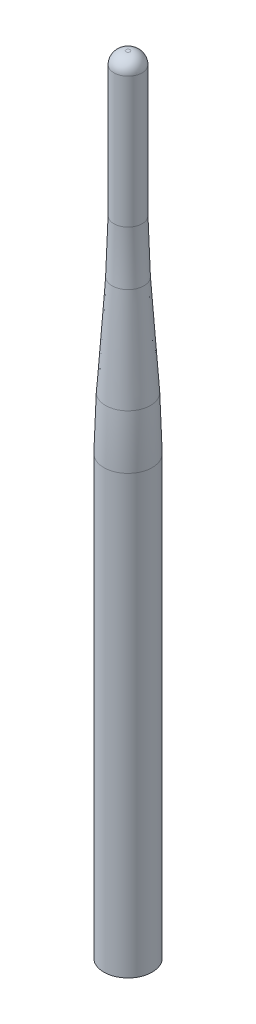
ISO-10303-21;
HEADER;
FILE_DESCRIPTION(('STEP AP214'),'2;1');
FILE_NAME('part.step','',(''),(''),'','','');
FILE_SCHEMA(('AUTOMOTIVE_DESIGN { 1 0 10303 214 1 1 1 1 }'));
ENDSEC;
DATA;
#1=APPLICATION_CONTEXT('core data for automotive mechanical design processes');
#2=APPLICATION_PROTOCOL_DEFINITION('international standard','automotive_design',2000,#1);
#3=PRODUCT_CONTEXT('',#1,'mechanical');
#4=PRODUCT('Part','Part','',(#3));
#5=PRODUCT_RELATED_PRODUCT_CATEGORY('part','',(#4));
#6=PRODUCT_DEFINITION_FORMATION('','',#4);
#7=PRODUCT_DEFINITION_CONTEXT('part definition',#1,'design');
#8=PRODUCT_DEFINITION('design','',#6,#7);
#9=PRODUCT_DEFINITION_SHAPE('','',#8);
#10=(LENGTH_UNIT() NAMED_UNIT(*) SI_UNIT(.MILLI.,.METRE.));
#11=(NAMED_UNIT(*) PLANE_ANGLE_UNIT() SI_UNIT($,.RADIAN.));
#12=(NAMED_UNIT(*) SI_UNIT($,.STERADIAN.) SOLID_ANGLE_UNIT());
#13=UNCERTAINTY_MEASURE_WITH_UNIT(LENGTH_MEASURE(1.E-05),#10,'distance_accuracy_value','');
#14=(GEOMETRIC_REPRESENTATION_CONTEXT(3) GLOBAL_UNCERTAINTY_ASSIGNED_CONTEXT((#13)) GLOBAL_UNIT_ASSIGNED_CONTEXT((#10,
#11,#12)) REPRESENTATION_CONTEXT('',''));
#15=CARTESIAN_POINT('',(0.,0.,0.));
#16=DIRECTION('',(0.,0.,1.));
#17=DIRECTION('',(1.,0.,0.));
#18=AXIS2_PLACEMENT_3D('',#15,#16,#17);
#19=CARTESIAN_POINT('',(0.,0.,0.));
#20=DIRECTION('',(0.,1.,0.));
#21=DIRECTION('',(0.,0.,1.));
#22=AXIS2_PLACEMENT_3D('',#19,#20,#21);
#23=PLANE('',#22);
#24=CARTESIAN_POINT('',(0.,0.,0.));
#25=DIRECTION('',(0.,-1.,0.));
#26=DIRECTION('',(0.,0.,-1.));
#27=AXIS2_PLACEMENT_3D('',#24,#25,#26);
#28=CIRCLE('',#27,6.);
#29=CARTESIAN_POINT('',(0.,0.,-6.));
#30=VERTEX_POINT('',#29);
#31=EDGE_CURVE('E10',#30,#30,#28,.T.);
#32=ORIENTED_EDGE('',*,*,#31,.T.);
#33=EDGE_LOOP('',(#32));
#34=FACE_BOUND('',#33,.T.);
#35=ADVANCED_FACE('F40',(#34),#23,.F.);
#36=CARTESIAN_POINT('',(0.,0.,0.));
#37=DIRECTION('',(0.,-1.,0.));
#38=DIRECTION('',(0.,0.,-1.));
#39=AXIS2_PLACEMENT_3D('',#36,#37,#38);
#40=CYLINDRICAL_SURFACE('',#39,5.99999999999999);
#41=ORIENTED_EDGE('',*,*,#31,.F.);
#42=EDGE_LOOP('',(#41));
#43=FACE_BOUND('',#42,.T.);
#44=CARTESIAN_POINT('',(0.,108.428156107261,0.));
#45=DIRECTION('',(0.,-1.,0.));
#46=DIRECTION('',(0.,0.,-1.));
#47=AXIS2_PLACEMENT_3D('',#44,#45,#46);
#48=CIRCLE('',#47,5.99999999999998);
#49=CARTESIAN_POINT('',(0.,108.428156107261,-5.99999999999998));
#50=VERTEX_POINT('',#49);
#51=EDGE_CURVE('E47',#50,#50,#48,.T.);
#52=ORIENTED_EDGE('',*,*,#51,.T.);
#53=EDGE_LOOP('',(#52));
#54=FACE_BOUND('',#53,.T.);
#55=ADVANCED_FACE('F88',(#43,#54),#40,.T.);
#56=CARTESIAN_POINT('',(0.,108.428156107262,0.));
#57=DIRECTION('',(0.,-1.,0.));
#58=DIRECTION('',(0.,0.,-1.));
#59=AXIS2_PLACEMENT_3D('',#56,#57,#58);
#60=DEGENERATE_TOROIDAL_SURFACE('',#59,194.,200.,.F.);
#61=ORIENTED_EDGE('',*,*,#51,.F.);
#62=EDGE_LOOP('',(#61));
#63=FACE_BOUND('',#62,.T.);
#64=CARTESIAN_POINT('',(0.,121.557667587579,0.));
#65=DIRECTION('',(0.,-1.,0.));
#66=DIRECTION('',(0.,0.,-1.));
#67=AXIS2_PLACEMENT_3D('',#64,#65,#66);
#68=CIRCLE('',#67,5.56857450081715);
#69=CARTESIAN_POINT('',(0.,121.557667587579,-5.56857450081715));
#70=VERTEX_POINT('',#69);
#71=EDGE_CURVE('E52',#70,#70,#68,.T.);
#72=ORIENTED_EDGE('',*,*,#71,.T.);
#73=EDGE_LOOP('',(#72));
#74=FACE_BOUND('',#73,.T.);
#75=ADVANCED_FACE('F92',(#63,#74),#60,.F.);
#76=CARTESIAN_POINT('',(0.,146.442332412421,0.));
#77=DIRECTION('',(0.,-1.,0.));
#78=DIRECTION('',(0.,0.,-1.));
#79=AXIS2_PLACEMENT_3D('',#76,#77,#78);
#80=CONICAL_SURFACE('',#79,3.93142549918282,0.0656948015524655);
#81=ORIENTED_EDGE('',*,*,#71,.F.);
#82=EDGE_LOOP('',(#81));
#83=FACE_BOUND('',#82,.T.);
#84=CARTESIAN_POINT('',(0.,146.442332412421,0.));
#85=DIRECTION('',(0.,-1.,0.));
#86=DIRECTION('',(0.,0.,-1.));
#87=AXIS2_PLACEMENT_3D('',#84,#85,#86);
#88=CIRCLE('',#87,3.93142549918282);
#89=CARTESIAN_POINT('',(0.,146.442332412421,-3.93142549918282));
#90=VERTEX_POINT('',#89);
#91=EDGE_CURVE('E57',#90,#90,#88,.T.);
#92=ORIENTED_EDGE('',*,*,#91,.T.);
#93=EDGE_LOOP('',(#92));
#94=FACE_BOUND('',#93,.T.);
#95=ADVANCED_FACE('F97',(#83,#94),#80,.T.);
#96=CARTESIAN_POINT('',(0.,159.571843892738,0.));
#97=DIRECTION('',(0.,-1.,0.));
#98=DIRECTION('',(0.,0.,-1.));
#99=AXIS2_PLACEMENT_3D('',#96,#97,#98);
#100=TOROIDAL_SURFACE('',#99,203.5,200.);
#101=ORIENTED_EDGE('',*,*,#91,.F.);
#102=EDGE_LOOP('',(#101));
#103=FACE_BOUND('',#102,.T.);
#104=CARTESIAN_POINT('',(0.,159.571843892739,0.));
#105=DIRECTION('',(0.,-1.,0.));
#106=DIRECTION('',(0.,0.,-1.));
#107=AXIS2_PLACEMENT_3D('',#104,#105,#106);
#108=CIRCLE('',#107,3.5);
#109=CARTESIAN_POINT('',(0.,159.571843892739,-3.5));
#110=VERTEX_POINT('',#109);
#111=EDGE_CURVE('E63',#110,#110,#108,.T.);
#112=ORIENTED_EDGE('',*,*,#111,.T.);
#113=EDGE_LOOP('',(#112));
#114=FACE_BOUND('',#113,.T.);
#115=ADVANCED_FACE('F103',(#103,#114),#100,.F.);
#116=CARTESIAN_POINT('',(0.,0.,0.));
#117=DIRECTION('',(0.,-1.,0.));
#118=DIRECTION('',(0.,0.,-1.));
#119=AXIS2_PLACEMENT_3D('',#116,#117,#118);
#120=CYLINDRICAL_SURFACE('',#119,3.5);
#121=ORIENTED_EDGE('',*,*,#111,.F.);
#122=EDGE_LOOP('',(#121));
#123=FACE_BOUND('',#122,.T.);
#124=CARTESIAN_POINT('',(0.,192.,0.));
#125=DIRECTION('',(0.,-1.,0.));
#126=DIRECTION('',(0.,0.,-1.));
#127=AXIS2_PLACEMENT_3D('',#124,#125,#126);
#128=CIRCLE('',#127,3.5);
#129=CARTESIAN_POINT('',(0.,192.,-3.5));
#130=VERTEX_POINT('',#129);
#131=EDGE_CURVE('E67',#130,#130,#128,.T.);
#132=ORIENTED_EDGE('',*,*,#131,.T.);
#133=EDGE_LOOP('',(#132));
#134=FACE_BOUND('',#133,.T.);
#135=ADVANCED_FACE('F84',(#123,#134),#120,.T.);
#136=CARTESIAN_POINT('',(0.,192.,0.));
#137=DIRECTION('',(0.,-1.,0.));
#138=DIRECTION('',(0.,0.,-1.));
#139=AXIS2_PLACEMENT_3D('',#136,#137,#138);
#140=DEGENERATE_TOROIDAL_SURFACE('',#139,0.5,3.,.T.);
#141=ORIENTED_EDGE('',*,*,#131,.F.);
#142=EDGE_LOOP('',(#141));
#143=FACE_BOUND('',#142,.T.);
#144=CARTESIAN_POINT('',(0.,195.,0.));
#145=DIRECTION('',(0.,-1.,0.));
#146=DIRECTION('',(0.,0.,-1.));
#147=AXIS2_PLACEMENT_3D('',#144,#145,#146);
#148=CIRCLE('',#147,0.499999999999979);
#149=CARTESIAN_POINT('',(0.,195.,-0.499999999999979));
#150=VERTEX_POINT('',#149);
#151=EDGE_CURVE('E71',#150,#150,#148,.T.);
#152=ORIENTED_EDGE('',*,*,#151,.T.);
#153=EDGE_LOOP('',(#152));
#154=FACE_BOUND('',#153,.T.);
#155=ADVANCED_FACE('F76',(#143,#154),#140,.T.);
#156=CARTESIAN_POINT('',(-0.499999999999979,195.,0.));
#157=DIRECTION('',(0.,-1.,0.));
#158=DIRECTION('',(0.,0.,-1.));
#159=AXIS2_PLACEMENT_3D('',#156,#157,#158);
#160=PLANE('',#159);
#161=ORIENTED_EDGE('',*,*,#151,.F.);
#162=EDGE_LOOP('',(#161));
#163=FACE_BOUND('',#162,.T.);
#164=ADVANCED_FACE('F78',(#163),#160,.F.);
#165=CLOSED_SHELL('',(#35,#55,#75,#95,#115,#135,#155,#164));
#166=MANIFOLD_SOLID_BREP('B2',#165);
#167=ADVANCED_BREP_SHAPE_REPRESENTATION('',(#18,#166),#14);
#168=SHAPE_DEFINITION_REPRESENTATION(#9,#167);
ENDSEC;
END-ISO-10303-21;
